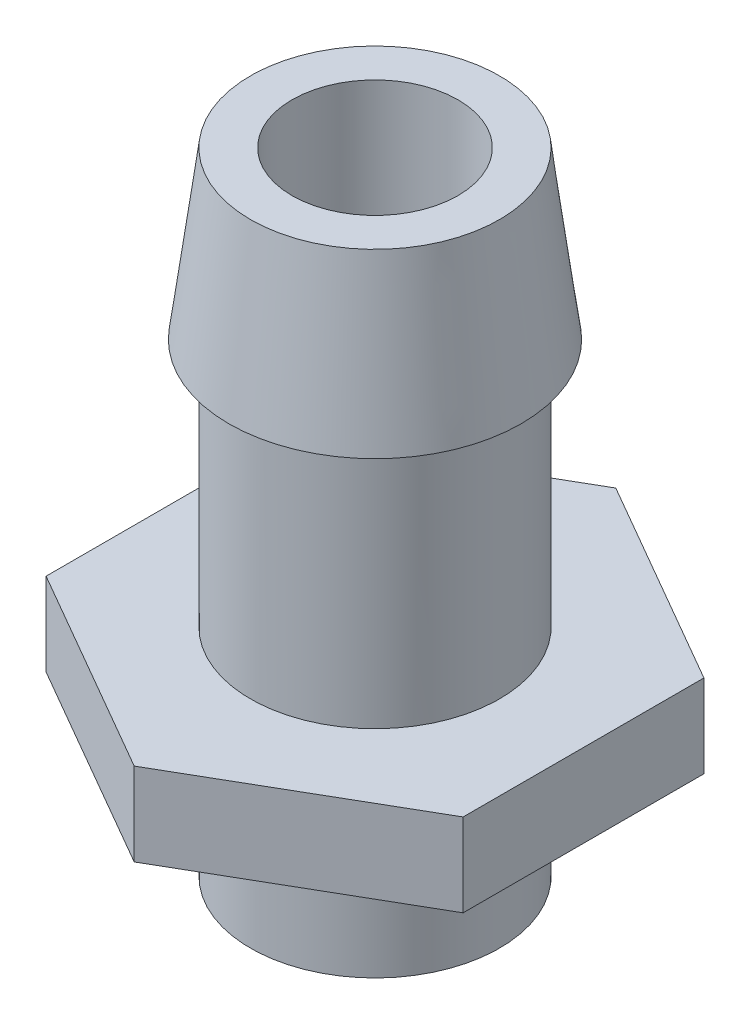
ISO-10303-21;
HEADER;
FILE_DESCRIPTION(('STEP AP214'),'2;1');
FILE_NAME('part.step','',(''),(''),'','','');
FILE_SCHEMA(('AUTOMOTIVE_DESIGN { 1 0 10303 214 1 1 1 1 }'));
ENDSEC;
DATA;
#1=APPLICATION_CONTEXT('core data for automotive mechanical design processes');
#2=APPLICATION_PROTOCOL_DEFINITION('international standard','automotive_design',2000,#1);
#3=PRODUCT_CONTEXT('',#1,'mechanical');
#4=PRODUCT('Part','Part','',(#3));
#5=PRODUCT_RELATED_PRODUCT_CATEGORY('part','',(#4));
#6=PRODUCT_DEFINITION_FORMATION('','',#4);
#7=PRODUCT_DEFINITION_CONTEXT('part definition',#1,'design');
#8=PRODUCT_DEFINITION('design','',#6,#7);
#9=PRODUCT_DEFINITION_SHAPE('','',#8);
#10=(LENGTH_UNIT() NAMED_UNIT(*) SI_UNIT(.MILLI.,.METRE.));
#11=(NAMED_UNIT(*) PLANE_ANGLE_UNIT() SI_UNIT($,.RADIAN.));
#12=(NAMED_UNIT(*) SI_UNIT($,.STERADIAN.) SOLID_ANGLE_UNIT());
#13=UNCERTAINTY_MEASURE_WITH_UNIT(LENGTH_MEASURE(1.E-05),#10,'distance_accuracy_value','');
#14=(GEOMETRIC_REPRESENTATION_CONTEXT(3) GLOBAL_UNCERTAINTY_ASSIGNED_CONTEXT((#13)) GLOBAL_UNIT_ASSIGNED_CONTEXT((#10,
#11,#12)) REPRESENTATION_CONTEXT('',''));
#15=CARTESIAN_POINT('',(0.,0.,0.));
#16=DIRECTION('',(0.,0.,1.));
#17=DIRECTION('',(1.,0.,0.));
#18=AXIS2_PLACEMENT_3D('',#15,#16,#17);
#19=CARTESIAN_POINT('',(0.,15.875,0.));
#20=DIRECTION('',(0.,-1.,0.));
#21=DIRECTION('',(0.,0.,-1.));
#22=AXIS2_PLACEMENT_3D('',#19,#20,#21);
#23=CYLINDRICAL_SURFACE('',#22,4.7625);
#24=CARTESIAN_POINT('',(0.,0.,0.));
#25=DIRECTION('',(0.,-1.,0.));
#26=DIRECTION('',(0.,0.,-1.));
#27=AXIS2_PLACEMENT_3D('',#24,#25,#26);
#28=CIRCLE('',#27,4.7625);
#29=CARTESIAN_POINT('',(0.,0.,-4.7625));
#30=VERTEX_POINT('',#29);
#31=EDGE_CURVE('E105',#30,#30,#28,.T.);
#32=ORIENTED_EDGE('',*,*,#31,.F.);
#33=EDGE_LOOP('',(#32));
#34=FACE_BOUND('',#33,.T.);
#35=CARTESIAN_POINT('',(0.,9.525,0.));
#36=DIRECTION('',(0.,1.,0.));
#37=DIRECTION('',(0.,0.,1.));
#38=AXIS2_PLACEMENT_3D('',#35,#36,#37);
#39=CIRCLE('',#38,4.7625);
#40=CARTESIAN_POINT('',(0.,9.525,4.7625));
#41=VERTEX_POINT('',#40);
#42=EDGE_CURVE('E11',#41,#41,#39,.T.);
#43=ORIENTED_EDGE('',*,*,#42,.F.);
#44=EDGE_LOOP('',(#43));
#45=FACE_BOUND('',#44,.T.);
#46=ADVANCED_FACE('F34',(#34,#45),#23,.T.);
#47=CARTESIAN_POINT('',(-7.97392890534522,-3.175,4.60375));
#48=DIRECTION('',(0.,-1.,0.));
#49=DIRECTION('',(0.,0.,-1.));
#50=AXIS2_PLACEMENT_3D('',#47,#48,#49);
#51=PLANE('',#50);
#52=CARTESIAN_POINT('',(0.,-3.175,0.));
#53=DIRECTION('',(0.,-1.,0.));
#54=DIRECTION('',(0.,0.,-1.));
#55=AXIS2_PLACEMENT_3D('',#52,#53,#54);
#56=CIRCLE('',#55,6.35);
#57=CARTESIAN_POINT('',(0.,-3.175,-6.35));
#58=VERTEX_POINT('',#57);
#59=EDGE_CURVE('E189',#58,#58,#56,.T.);
#60=ORIENTED_EDGE('',*,*,#59,.F.);
#61=EDGE_LOOP('',(#60));
#62=FACE_BOUND('',#61,.T.);
#63=DIRECTION('',(-0.866025403784439,0.,-0.5));
#64=VECTOR('',#63,1.);
#65=CARTESIAN_POINT('',(0.,-3.175,9.2075));
#66=LINE('',#65,#64);
#67=CARTESIAN_POINT('',(0.,-3.175,9.2075));
#68=VERTEX_POINT('',#67);
#69=CARTESIAN_POINT('',(-7.97392890534522,-3.175,4.60375));
#70=VERTEX_POINT('',#69);
#71=EDGE_CURVE('E125',#68,#70,#66,.T.);
#72=ORIENTED_EDGE('',*,*,#71,.T.);
#73=DIRECTION('',(0.,0.,-1.));
#74=VECTOR('',#73,1.);
#75=CARTESIAN_POINT('',(-7.97392890534522,-3.175,4.60375));
#76=LINE('',#75,#74);
#77=CARTESIAN_POINT('',(-7.97392890534522,-3.175,-4.60375));
#78=VERTEX_POINT('',#77);
#79=EDGE_CURVE('E102',#70,#78,#76,.T.);
#80=ORIENTED_EDGE('',*,*,#79,.T.);
#81=DIRECTION('',(0.866025403784439,0.,-0.5));
#82=VECTOR('',#81,1.);
#83=CARTESIAN_POINT('',(0.,-3.175,-9.2075));
#84=LINE('',#83,#82);
#85=CARTESIAN_POINT('',(0.,-3.175,-9.2075));
#86=VERTEX_POINT('',#85);
#87=EDGE_CURVE('E128',#78,#86,#84,.T.);
#88=ORIENTED_EDGE('',*,*,#87,.T.);
#89=DIRECTION('',(0.866025403784439,0.,0.5));
#90=VECTOR('',#89,1.);
#91=CARTESIAN_POINT('',(0.,-3.175,-9.2075));
#92=LINE('',#91,#90);
#93=CARTESIAN_POINT('',(7.97392890534522,-3.175,-4.60375));
#94=VERTEX_POINT('',#93);
#95=EDGE_CURVE('E130',#86,#94,#92,.T.);
#96=ORIENTED_EDGE('',*,*,#95,.T.);
#97=DIRECTION('',(0.,0.,1.));
#98=VECTOR('',#97,1.);
#99=CARTESIAN_POINT('',(7.97392890534522,-3.175,4.60375));
#100=LINE('',#99,#98);
#101=CARTESIAN_POINT('',(7.97392890534522,-3.175,4.60375));
#102=VERTEX_POINT('',#101);
#103=EDGE_CURVE('E53',#94,#102,#100,.T.);
#104=ORIENTED_EDGE('',*,*,#103,.T.);
#105=DIRECTION('',(-0.866025403784439,0.,0.5));
#106=VECTOR('',#105,1.);
#107=CARTESIAN_POINT('',(0.,-3.175,9.2075));
#108=LINE('',#107,#106);
#109=EDGE_CURVE('E48',#102,#68,#108,.T.);
#110=ORIENTED_EDGE('',*,*,#109,.T.);
#111=EDGE_LOOP('',(#72,#80,#88,#96,#104,#110));
#112=FACE_BOUND('',#111,.T.);
#113=ADVANCED_FACE('F154',(#62,#112),#51,.T.);
#114=CARTESIAN_POINT('',(0.,15.875,0.));
#115=DIRECTION('',(0.,1.,0.));
#116=DIRECTION('',(0.,0.,1.));
#117=AXIS2_PLACEMENT_3D('',#114,#115,#116);
#118=PLANE('',#117);
#119=CARTESIAN_POINT('',(0.,15.875,0.));
#120=DIRECTION('',(0.,1.,0.));
#121=DIRECTION('',(0.,0.,1.));
#122=AXIS2_PLACEMENT_3D('',#119,#120,#121);
#123=CIRCLE('',#122,4.7625);
#124=CARTESIAN_POINT('',(0.,15.875,4.7625));
#125=VERTEX_POINT('',#124);
#126=EDGE_CURVE('E182',#125,#125,#123,.T.);
#127=ORIENTED_EDGE('',*,*,#126,.T.);
#128=EDGE_LOOP('',(#127));
#129=FACE_BOUND('',#128,.T.);
#130=CARTESIAN_POINT('',(0.,15.875,0.));
#131=DIRECTION('',(0.,1.,0.));
#132=DIRECTION('',(0.,0.,1.));
#133=AXIS2_PLACEMENT_3D('',#130,#131,#132);
#134=CIRCLE('',#133,3.175);
#135=CARTESIAN_POINT('',(0.,15.875,3.175));
#136=VERTEX_POINT('',#135);
#137=EDGE_CURVE('E41',#136,#136,#134,.T.);
#138=ORIENTED_EDGE('',*,*,#137,.F.);
#139=EDGE_LOOP('',(#138));
#140=FACE_BOUND('',#139,.T.);
#141=ADVANCED_FACE('F152',(#129,#140),#118,.T.);
#142=CARTESIAN_POINT('',(0.,15.875,0.));
#143=DIRECTION('',(0.,-1.,0.));
#144=DIRECTION('',(0.,0.,-1.));
#145=AXIS2_PLACEMENT_3D('',#142,#143,#144);
#146=CYLINDRICAL_SURFACE('',#145,3.175);
#147=ORIENTED_EDGE('',*,*,#137,.T.);
#148=EDGE_LOOP('',(#147));
#149=FACE_BOUND('',#148,.T.);
#150=CARTESIAN_POINT('',(0.,-8.255,0.));
#151=DIRECTION('',(0.,-1.,0.));
#152=DIRECTION('',(0.,0.,-1.));
#153=AXIS2_PLACEMENT_3D('',#150,#151,#152);
#154=CIRCLE('',#153,3.175);
#155=CARTESIAN_POINT('',(0.,-8.255,-3.175));
#156=VERTEX_POINT('',#155);
#157=EDGE_CURVE('E114',#156,#156,#154,.T.);
#158=ORIENTED_EDGE('',*,*,#157,.T.);
#159=EDGE_LOOP('',(#158));
#160=FACE_BOUND('',#159,.T.);
#161=ADVANCED_FACE('F149',(#149,#160),#146,.F.);
#162=CARTESIAN_POINT('',(-7.97392890534522,0.,4.60375));
#163=DIRECTION('',(0.,-1.,0.));
#164=DIRECTION('',(0.,0.,-1.));
#165=AXIS2_PLACEMENT_3D('',#162,#163,#164);
#166=PLANE('',#165);
#167=DIRECTION('',(-0.866025403784439,0.,-0.5));
#168=VECTOR('',#167,1.);
#169=CARTESIAN_POINT('',(0.,0.,9.2075));
#170=LINE('',#169,#168);
#171=CARTESIAN_POINT('',(0.,0.,9.2075));
#172=VERTEX_POINT('',#171);
#173=CARTESIAN_POINT('',(-7.97392890534522,0.,4.60375));
#174=VERTEX_POINT('',#173);
#175=EDGE_CURVE('E92',#172,#174,#170,.T.);
#176=ORIENTED_EDGE('',*,*,#175,.F.);
#177=DIRECTION('',(-0.866025403784439,0.,0.5));
#178=VECTOR('',#177,1.);
#179=CARTESIAN_POINT('',(0.,0.,9.2075));
#180=LINE('',#179,#178);
#181=CARTESIAN_POINT('',(7.97392890534522,0.,4.60375));
#182=VERTEX_POINT('',#181);
#183=EDGE_CURVE('E123',#182,#172,#180,.T.);
#184=ORIENTED_EDGE('',*,*,#183,.F.);
#185=DIRECTION('',(0.,0.,1.));
#186=VECTOR('',#185,1.);
#187=CARTESIAN_POINT('',(7.97392890534522,0.,4.60375));
#188=LINE('',#187,#186);
#189=CARTESIAN_POINT('',(7.97392890534522,0.,-4.60375));
#190=VERTEX_POINT('',#189);
#191=EDGE_CURVE('E121',#190,#182,#188,.T.);
#192=ORIENTED_EDGE('',*,*,#191,.F.);
#193=DIRECTION('',(0.866025403784439,0.,0.5));
#194=VECTOR('',#193,1.);
#195=CARTESIAN_POINT('',(0.,0.,-9.2075));
#196=LINE('',#195,#194);
#197=CARTESIAN_POINT('',(0.,0.,-9.2075));
#198=VERTEX_POINT('',#197);
#199=EDGE_CURVE('E119',#198,#190,#196,.T.);
#200=ORIENTED_EDGE('',*,*,#199,.F.);
#201=DIRECTION('',(0.866025403784439,0.,-0.5));
#202=VECTOR('',#201,1.);
#203=CARTESIAN_POINT('',(0.,0.,-9.2075));
#204=LINE('',#203,#202);
#205=CARTESIAN_POINT('',(-7.97392890534522,0.,-4.60375));
#206=VERTEX_POINT('',#205);
#207=EDGE_CURVE('E94',#206,#198,#204,.T.);
#208=ORIENTED_EDGE('',*,*,#207,.F.);
#209=DIRECTION('',(0.,0.,-1.));
#210=VECTOR('',#209,1.);
#211=CARTESIAN_POINT('',(-7.97392890534522,0.,4.60375));
#212=LINE('',#211,#210);
#213=EDGE_CURVE('E86',#174,#206,#212,.T.);
#214=ORIENTED_EDGE('',*,*,#213,.F.);
#215=EDGE_LOOP('',(#176,#184,#192,#200,#208,#214));
#216=FACE_BOUND('',#215,.T.);
#217=ORIENTED_EDGE('',*,*,#31,.T.);
#218=EDGE_LOOP('',(#217));
#219=FACE_BOUND('',#218,.T.);
#220=ADVANCED_FACE('F88',(#216,#219),#166,.F.);
#221=CARTESIAN_POINT('',(0.,-3.175,9.2075));
#222=DIRECTION('',(0.5,0.,-0.866025403784439));
#223=DIRECTION('',(-0.866025403784439,0.,-0.5));
#224=AXIS2_PLACEMENT_3D('',#221,#222,#223);
#225=PLANE('',#224);
#226=ORIENTED_EDGE('',*,*,#175,.T.);
#227=DIRECTION('',(0.,1.,0.));
#228=VECTOR('',#227,1.);
#229=CARTESIAN_POINT('',(-7.97392890534522,-3.175,4.60375));
#230=LINE('',#229,#228);
#231=EDGE_CURVE('E100',#70,#174,#230,.T.);
#232=ORIENTED_EDGE('',*,*,#231,.F.);
#233=ORIENTED_EDGE('',*,*,#71,.F.);
#234=DIRECTION('',(0.,1.,0.));
#235=VECTOR('',#234,1.);
#236=CARTESIAN_POINT('',(0.,-3.175,9.2075));
#237=LINE('',#236,#235);
#238=EDGE_CURVE('E110',#68,#172,#237,.T.);
#239=ORIENTED_EDGE('',*,*,#238,.T.);
#240=EDGE_LOOP('',(#226,#232,#233,#239));
#241=FACE_BOUND('',#240,.T.);
#242=ADVANCED_FACE('F109',(#241),#225,.F.);
#243=CARTESIAN_POINT('',(-7.97392890534522,-3.175,4.60375));
#244=DIRECTION('',(1.,0.,0.));
#245=DIRECTION('',(0.,0.,-1.));
#246=AXIS2_PLACEMENT_3D('',#243,#244,#245);
#247=PLANE('',#246);
#248=ORIENTED_EDGE('',*,*,#213,.T.);
#249=DIRECTION('',(0.,1.,0.));
#250=VECTOR('',#249,1.);
#251=CARTESIAN_POINT('',(-7.97392890534522,-3.175,-4.60375));
#252=LINE('',#251,#250);
#253=EDGE_CURVE('E106',#78,#206,#252,.T.);
#254=ORIENTED_EDGE('',*,*,#253,.F.);
#255=ORIENTED_EDGE('',*,*,#79,.F.);
#256=ORIENTED_EDGE('',*,*,#231,.T.);
#257=EDGE_LOOP('',(#248,#254,#255,#256));
#258=FACE_BOUND('',#257,.T.);
#259=ADVANCED_FACE('F101',(#258),#247,.F.);
#260=CARTESIAN_POINT('',(0.,-3.175,-9.2075));
#261=DIRECTION('',(0.5,0.,0.866025403784439));
#262=DIRECTION('',(0.866025403784439,0.,-0.5));
#263=AXIS2_PLACEMENT_3D('',#260,#261,#262);
#264=PLANE('',#263);
#265=ORIENTED_EDGE('',*,*,#207,.T.);
#266=DIRECTION('',(0.,1.,0.));
#267=VECTOR('',#266,1.);
#268=CARTESIAN_POINT('',(0.,-3.175,-9.2075));
#269=LINE('',#268,#267);
#270=EDGE_CURVE('E141',#86,#198,#269,.T.);
#271=ORIENTED_EDGE('',*,*,#270,.F.);
#272=ORIENTED_EDGE('',*,*,#87,.F.);
#273=ORIENTED_EDGE('',*,*,#253,.T.);
#274=EDGE_LOOP('',(#265,#271,#272,#273));
#275=FACE_BOUND('',#274,.T.);
#276=ADVANCED_FACE('F224',(#275),#264,.F.);
#277=CARTESIAN_POINT('',(0.,-3.175,-9.2075));
#278=DIRECTION('',(-0.5,0.,0.866025403784439));
#279=DIRECTION('',(0.866025403784439,0.,0.5));
#280=AXIS2_PLACEMENT_3D('',#277,#278,#279);
#281=PLANE('',#280);
#282=ORIENTED_EDGE('',*,*,#199,.T.);
#283=DIRECTION('',(0.,1.,0.));
#284=VECTOR('',#283,1.);
#285=CARTESIAN_POINT('',(7.97392890534522,-3.175,-4.60375));
#286=LINE('',#285,#284);
#287=EDGE_CURVE('E138',#94,#190,#286,.T.);
#288=ORIENTED_EDGE('',*,*,#287,.F.);
#289=ORIENTED_EDGE('',*,*,#95,.F.);
#290=ORIENTED_EDGE('',*,*,#270,.T.);
#291=EDGE_LOOP('',(#282,#288,#289,#290));
#292=FACE_BOUND('',#291,.T.);
#293=ADVANCED_FACE('F220',(#292),#281,.F.);
#294=CARTESIAN_POINT('',(7.97392890534522,-3.175,4.60375));
#295=DIRECTION('',(-1.,0.,0.));
#296=DIRECTION('',(0.,0.,1.));
#297=AXIS2_PLACEMENT_3D('',#294,#295,#296);
#298=PLANE('',#297);
#299=ORIENTED_EDGE('',*,*,#191,.T.);
#300=DIRECTION('',(0.,1.,0.));
#301=VECTOR('',#300,1.);
#302=CARTESIAN_POINT('',(7.97392890534522,-3.175,4.60375));
#303=LINE('',#302,#301);
#304=EDGE_CURVE('E135',#102,#182,#303,.T.);
#305=ORIENTED_EDGE('',*,*,#304,.F.);
#306=ORIENTED_EDGE('',*,*,#103,.F.);
#307=ORIENTED_EDGE('',*,*,#287,.T.);
#308=EDGE_LOOP('',(#299,#305,#306,#307));
#309=FACE_BOUND('',#308,.T.);
#310=ADVANCED_FACE('F210',(#309),#298,.F.);
#311=CARTESIAN_POINT('',(0.,-3.175,9.2075));
#312=DIRECTION('',(-0.5,0.,-0.866025403784439));
#313=DIRECTION('',(-0.866025403784439,0.,0.5));
#314=AXIS2_PLACEMENT_3D('',#311,#312,#313);
#315=PLANE('',#314);
#316=ORIENTED_EDGE('',*,*,#183,.T.);
#317=ORIENTED_EDGE('',*,*,#238,.F.);
#318=ORIENTED_EDGE('',*,*,#109,.F.);
#319=ORIENTED_EDGE('',*,*,#304,.T.);
#320=EDGE_LOOP('',(#316,#317,#318,#319));
#321=FACE_BOUND('',#320,.T.);
#322=ADVANCED_FACE('F200',(#321),#315,.F.);
#323=CARTESIAN_POINT('',(0.,-8.255,0.));
#324=DIRECTION('',(0.,-1.,0.));
#325=DIRECTION('',(0.,0.,-1.));
#326=AXIS2_PLACEMENT_3D('',#323,#324,#325);
#327=PLANE('',#326);
#328=CARTESIAN_POINT('',(0.,-8.255,0.));
#329=DIRECTION('',(0.,-1.,0.));
#330=DIRECTION('',(0.,0.,-1.));
#331=AXIS2_PLACEMENT_3D('',#328,#329,#330);
#332=CIRCLE('',#331,4.7625);
#333=CARTESIAN_POINT('',(0.,-8.255,-4.7625));
#334=VERTEX_POINT('',#333);
#335=EDGE_CURVE('E111',#334,#334,#332,.T.);
#336=ORIENTED_EDGE('',*,*,#335,.T.);
#337=EDGE_LOOP('',(#336));
#338=FACE_BOUND('',#337,.T.);
#339=ORIENTED_EDGE('',*,*,#157,.F.);
#340=EDGE_LOOP('',(#339));
#341=FACE_BOUND('',#340,.T.);
#342=ADVANCED_FACE('F197',(#338,#341),#327,.T.);
#343=CARTESIAN_POINT('',(0.,-8.255,0.));
#344=DIRECTION('',(0.,1.,0.));
#345=DIRECTION('',(0.,0.,1.));
#346=AXIS2_PLACEMENT_3D('',#343,#344,#345);
#347=CYLINDRICAL_SURFACE('',#346,4.7625);
#348=ORIENTED_EDGE('',*,*,#335,.F.);
#349=EDGE_LOOP('',(#348));
#350=FACE_BOUND('',#349,.T.);
#351=CARTESIAN_POINT('',(0.,-1.5875,0.));
#352=DIRECTION('',(0.,-1.,0.));
#353=DIRECTION('',(0.,0.,-1.));
#354=AXIS2_PLACEMENT_3D('',#351,#352,#353);
#355=CIRCLE('',#354,4.7625);
#356=CARTESIAN_POINT('',(0.,-1.5875,-4.7625));
#357=VERTEX_POINT('',#356);
#358=EDGE_CURVE('E184',#357,#357,#355,.T.);
#359=ORIENTED_EDGE('',*,*,#358,.T.);
#360=EDGE_LOOP('',(#359));
#361=FACE_BOUND('',#360,.T.);
#362=ADVANCED_FACE('F199',(#350,#361),#347,.T.);
#363=CARTESIAN_POINT('',(0.,-1.5875,0.));
#364=DIRECTION('',(0.,-1.,0.));
#365=DIRECTION('',(0.,0.,-1.));
#366=AXIS2_PLACEMENT_3D('',#363,#364,#365);
#367=CYLINDRICAL_SURFACE('',#366,6.35);
#368=CARTESIAN_POINT('',(0.,-1.5875,0.));
#369=DIRECTION('',(0.,-1.,0.));
#370=DIRECTION('',(0.,0.,-1.));
#371=AXIS2_PLACEMENT_3D('',#368,#369,#370);
#372=CIRCLE('',#371,6.35);
#373=CARTESIAN_POINT('',(0.,-1.5875,-6.35));
#374=VERTEX_POINT('',#373);
#375=EDGE_CURVE('E192',#374,#374,#372,.T.);
#376=ORIENTED_EDGE('',*,*,#375,.F.);
#377=EDGE_LOOP('',(#376));
#378=FACE_BOUND('',#377,.T.);
#379=ORIENTED_EDGE('',*,*,#59,.T.);
#380=EDGE_LOOP('',(#379));
#381=FACE_BOUND('',#380,.T.);
#382=ADVANCED_FACE('F207',(#378,#381),#367,.F.);
#383=CARTESIAN_POINT('',(0.,-1.5875,0.));
#384=DIRECTION('',(0.,-1.,0.));
#385=DIRECTION('',(0.,0.,-1.));
#386=AXIS2_PLACEMENT_3D('',#383,#384,#385);
#387=PLANE('',#386);
#388=ORIENTED_EDGE('',*,*,#358,.F.);
#389=EDGE_LOOP('',(#388));
#390=FACE_BOUND('',#389,.T.);
#391=ORIENTED_EDGE('',*,*,#375,.T.);
#392=EDGE_LOOP('',(#391));
#393=FACE_BOUND('',#392,.T.);
#394=ADVANCED_FACE('F176',(#390,#393),#387,.T.);
#395=CARTESIAN_POINT('',(0.,9.525,0.));
#396=DIRECTION('',(0.,1.,0.));
#397=DIRECTION('',(0.,0.,1.));
#398=AXIS2_PLACEMENT_3D('',#395,#396,#397);
#399=PLANE('',#398);
#400=ORIENTED_EDGE('',*,*,#42,.T.);
#401=EDGE_LOOP('',(#400));
#402=FACE_BOUND('',#401,.T.);
#403=CARTESIAN_POINT('',(0.,9.525,0.));
#404=DIRECTION('',(0.,1.,0.));
#405=DIRECTION('',(0.,0.,1.));
#406=AXIS2_PLACEMENT_3D('',#403,#404,#405);
#407=CIRCLE('',#406,5.588);
#408=CARTESIAN_POINT('',(0.,9.525,5.588));
#409=VERTEX_POINT('',#408);
#410=EDGE_CURVE('E180',#409,#409,#407,.T.);
#411=ORIENTED_EDGE('',*,*,#410,.F.);
#412=EDGE_LOOP('',(#411));
#413=FACE_BOUND('',#412,.T.);
#414=ADVANCED_FACE('F172',(#402,#413),#399,.F.);
#415=CARTESIAN_POINT('',(0.,9.525,0.));
#416=DIRECTION('',(0.,-1.,0.));
#417=DIRECTION('',(0.,0.,-1.));
#418=AXIS2_PLACEMENT_3D('',#415,#416,#417);
#419=CONICAL_SURFACE('',#418,5.588,0.129275004048143);
#420=ORIENTED_EDGE('',*,*,#126,.F.);
#421=EDGE_LOOP('',(#420));
#422=FACE_BOUND('',#421,.T.);
#423=ORIENTED_EDGE('',*,*,#410,.T.);
#424=EDGE_LOOP('',(#423));
#425=FACE_BOUND('',#424,.T.);
#426=ADVANCED_FACE('F175',(#422,#425),#419,.T.);
#427=CLOSED_SHELL('',(#46,#113,#141,#161,#220,#242,#259,#276,#293,#310,#322,#342,#362,#382,#394,
#414,#426));
#428=MANIFOLD_SOLID_BREP('B2',#427);
#429=ADVANCED_BREP_SHAPE_REPRESENTATION('',(#18,#428),#14);
#430=SHAPE_DEFINITION_REPRESENTATION(#9,#429);
ENDSEC;
END-ISO-10303-21;
